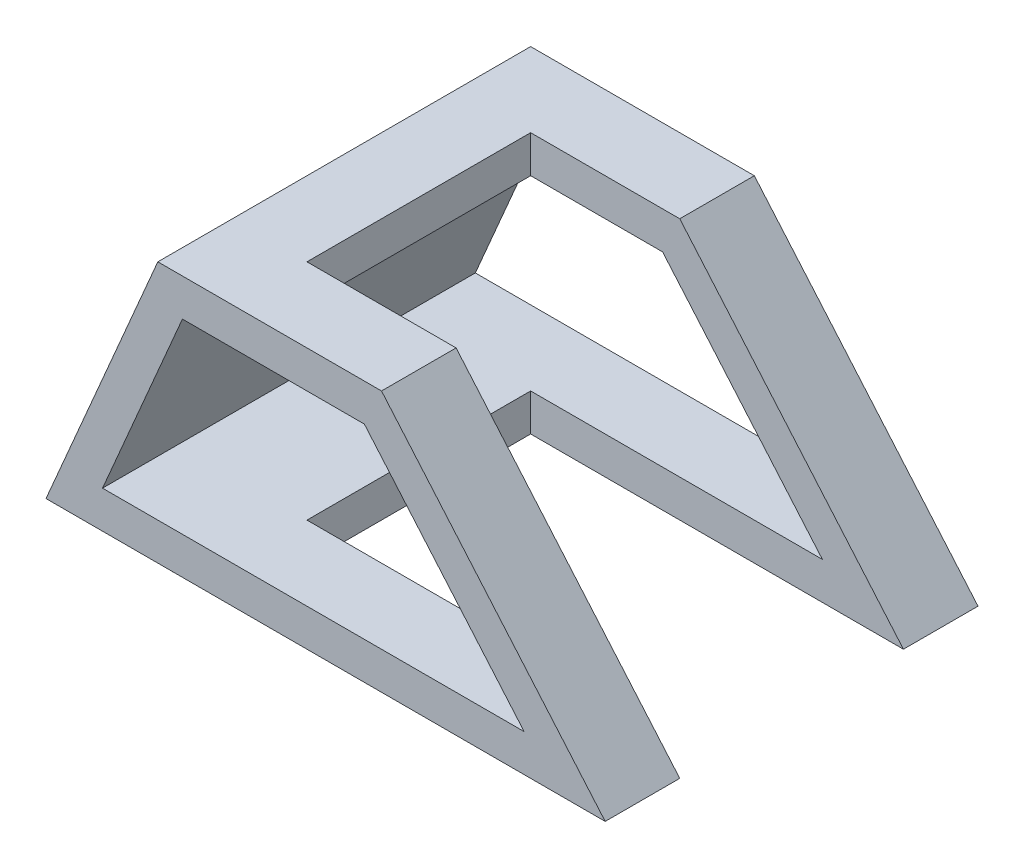
ISO-10303-21;
HEADER;
FILE_DESCRIPTION(('STEP AP214'),'2;1');
FILE_NAME('part.step','',(''),(''),'','','');
FILE_SCHEMA(('AUTOMOTIVE_DESIGN { 1 0 10303 214 1 1 1 1 }'));
ENDSEC;
DATA;
#1=APPLICATION_CONTEXT('core data for automotive mechanical design processes');
#2=APPLICATION_PROTOCOL_DEFINITION('international standard','automotive_design',2000,#1);
#3=PRODUCT_CONTEXT('',#1,'mechanical');
#4=PRODUCT('Part','Part','',(#3));
#5=PRODUCT_RELATED_PRODUCT_CATEGORY('part','',(#4));
#6=PRODUCT_DEFINITION_FORMATION('','',#4);
#7=PRODUCT_DEFINITION_CONTEXT('part definition',#1,'design');
#8=PRODUCT_DEFINITION('design','',#6,#7);
#9=PRODUCT_DEFINITION_SHAPE('','',#8);
#10=(LENGTH_UNIT() NAMED_UNIT(*) SI_UNIT(.MILLI.,.METRE.));
#11=(NAMED_UNIT(*) PLANE_ANGLE_UNIT() SI_UNIT($,.RADIAN.));
#12=(NAMED_UNIT(*) SI_UNIT($,.STERADIAN.) SOLID_ANGLE_UNIT());
#13=UNCERTAINTY_MEASURE_WITH_UNIT(LENGTH_MEASURE(1.E-05),#10,'distance_accuracy_value','');
#14=(GEOMETRIC_REPRESENTATION_CONTEXT(3) GLOBAL_UNCERTAINTY_ASSIGNED_CONTEXT((#13)) GLOBAL_UNIT_ASSIGNED_CONTEXT((#10,
#11,#12)) REPRESENTATION_CONTEXT('',''));
#15=CARTESIAN_POINT('',(0.,0.,0.));
#16=DIRECTION('',(0.,0.,1.));
#17=DIRECTION('',(1.,0.,0.));
#18=AXIS2_PLACEMENT_3D('',#15,#16,#17);
#19=CARTESIAN_POINT('',(0.,0.,50.));
#20=DIRECTION('',(0.,1.,0.));
#21=DIRECTION('',(0.,0.,1.));
#22=AXIS2_PLACEMENT_3D('',#19,#20,#21);
#23=PLANE('',#22);
#24=DIRECTION('',(1.,0.,0.));
#25=VECTOR('',#24,1.);
#26=CARTESIAN_POINT('',(0.,0.,-30.));
#27=LINE('',#26,#25);
#28=CARTESIAN_POINT('',(50.,0.,-30.));
#29=VERTEX_POINT('',#28);
#30=CARTESIAN_POINT('',(150.,0.,-30.));
#31=VERTEX_POINT('',#30);
#32=EDGE_CURVE('E172',#29,#31,#27,.T.);
#33=ORIENTED_EDGE('',*,*,#32,.F.);
#34=DIRECTION('',(0.,0.,1.));
#35=VECTOR('',#34,1.);
#36=CARTESIAN_POINT('',(50.,0.,-30.));
#37=LINE('',#36,#35);
#38=CARTESIAN_POINT('',(50.,0.,30.));
#39=VERTEX_POINT('',#38);
#40=EDGE_CURVE('E156',#29,#39,#37,.T.);
#41=ORIENTED_EDGE('',*,*,#40,.T.);
#42=DIRECTION('',(1.,0.,0.));
#43=VECTOR('',#42,1.);
#44=CARTESIAN_POINT('',(0.,0.,30.));
#45=LINE('',#44,#43);
#46=CARTESIAN_POINT('',(150.,0.,30.));
#47=VERTEX_POINT('',#46);
#48=EDGE_CURVE('E195',#39,#47,#45,.T.);
#49=ORIENTED_EDGE('',*,*,#48,.T.);
#50=DIRECTION('',(0.,0.,-1.));
#51=VECTOR('',#50,1.);
#52=CARTESIAN_POINT('',(150.,0.,50.));
#53=LINE('',#52,#51);
#54=CARTESIAN_POINT('',(150.,0.,50.));
#55=VERTEX_POINT('',#54);
#56=EDGE_CURVE('E11',#55,#47,#53,.T.);
#57=ORIENTED_EDGE('',*,*,#56,.F.);
#58=DIRECTION('',(1.,0.,0.));
#59=VECTOR('',#58,1.);
#60=CARTESIAN_POINT('',(0.,0.,50.));
#61=LINE('',#60,#59);
#62=CARTESIAN_POINT('',(0.,0.,50.));
#63=VERTEX_POINT('',#62);
#64=EDGE_CURVE('E227',#63,#55,#61,.T.);
#65=ORIENTED_EDGE('',*,*,#64,.F.);
#66=DIRECTION('',(0.,0.,-1.));
#67=VECTOR('',#66,1.);
#68=CARTESIAN_POINT('',(0.,0.,50.));
#69=LINE('',#68,#67);
#70=CARTESIAN_POINT('',(0.,0.,-50.));
#71=VERTEX_POINT('',#70);
#72=EDGE_CURVE('E256',#63,#71,#69,.T.);
#73=ORIENTED_EDGE('',*,*,#72,.T.);
#74=DIRECTION('',(1.,0.,0.));
#75=VECTOR('',#74,1.);
#76=CARTESIAN_POINT('',(0.,0.,-50.));
#77=LINE('',#76,#75);
#78=CARTESIAN_POINT('',(150.,0.,-50.));
#79=VERTEX_POINT('',#78);
#80=EDGE_CURVE('E248',#71,#79,#77,.T.);
#81=ORIENTED_EDGE('',*,*,#80,.T.);
#82=EDGE_CURVE('E51',#31,#79,#53,.T.);
#83=ORIENTED_EDGE('',*,*,#82,.F.);
#84=EDGE_LOOP('',(#33,#41,#49,#57,#65,#73,#81,#83));
#85=FACE_BOUND('',#84,.T.);
#86=ADVANCED_FACE('F42',(#85),#23,.F.);
#87=CARTESIAN_POINT('',(86.4705882352941,74.1176470588235,50.));
#88=DIRECTION('',(-0.759256602365297,-0.650791373455968,0.));
#89=DIRECTION('',(0.650791373455968,-0.759256602365297,0.));
#90=AXIS2_PLACEMENT_3D('',#87,#88,#89);
#91=PLANE('',#90);
#92=DIRECTION('',(-0.650791373455968,0.759256602365297,0.));
#93=VECTOR('',#92,1.);
#94=CARTESIAN_POINT('',(86.4705882352941,74.1176470588235,-30.));
#95=LINE('',#94,#93);
#96=CARTESIAN_POINT('',(90.,70.,-30.));
#97=VERTEX_POINT('',#96);
#98=EDGE_CURVE('E180',#31,#97,#95,.T.);
#99=ORIENTED_EDGE('',*,*,#98,.F.);
#100=ORIENTED_EDGE('',*,*,#82,.T.);
#101=DIRECTION('',(-0.650791373455968,0.759256602365297,0.));
#102=VECTOR('',#101,1.);
#103=CARTESIAN_POINT('',(86.4705882352941,74.1176470588235,-50.));
#104=LINE('',#103,#102);
#105=CARTESIAN_POINT('',(90.,70.,-50.));
#106=VERTEX_POINT('',#105);
#107=EDGE_CURVE('E250',#79,#106,#104,.T.);
#108=ORIENTED_EDGE('',*,*,#107,.T.);
#109=DIRECTION('',(0.,0.,-1.));
#110=VECTOR('',#109,1.);
#111=CARTESIAN_POINT('',(90.,70.,50.));
#112=LINE('',#111,#110);
#113=EDGE_CURVE('E262',#97,#106,#112,.T.);
#114=ORIENTED_EDGE('',*,*,#113,.F.);
#115=EDGE_LOOP('',(#99,#100,#108,#114));
#116=FACE_BOUND('',#115,.T.);
#117=ADVANCED_FACE('F320',(#116),#91,.F.);
#118=CARTESIAN_POINT('',(0.,70.,50.));
#119=DIRECTION('',(0.,-1.,0.));
#120=DIRECTION('',(1.,0.,0.));
#121=AXIS2_PLACEMENT_3D('',#118,#119,#120);
#122=PLANE('',#121);
#123=DIRECTION('',(-1.,0.,0.));
#124=VECTOR('',#123,1.);
#125=CARTESIAN_POINT('',(0.,70.,-30.));
#126=LINE('',#125,#124);
#127=CARTESIAN_POINT('',(50.,70.,-30.));
#128=VERTEX_POINT('',#127);
#129=EDGE_CURVE('E182',#97,#128,#126,.T.);
#130=ORIENTED_EDGE('',*,*,#129,.F.);
#131=ORIENTED_EDGE('',*,*,#113,.T.);
#132=DIRECTION('',(-1.,0.,0.));
#133=VECTOR('',#132,1.);
#134=CARTESIAN_POINT('',(0.,70.,-50.));
#135=LINE('',#134,#133);
#136=CARTESIAN_POINT('',(30.,70.,-50.));
#137=VERTEX_POINT('',#136);
#138=EDGE_CURVE('E253',#106,#137,#135,.T.);
#139=ORIENTED_EDGE('',*,*,#138,.T.);
#140=DIRECTION('',(0.,0.,-1.));
#141=VECTOR('',#140,1.);
#142=CARTESIAN_POINT('',(30.,70.,50.));
#143=LINE('',#142,#141);
#144=CARTESIAN_POINT('',(30.,70.,50.));
#145=VERTEX_POINT('',#144);
#146=EDGE_CURVE('E259',#145,#137,#143,.T.);
#147=ORIENTED_EDGE('',*,*,#146,.F.);
#148=DIRECTION('',(-1.,0.,0.));
#149=VECTOR('',#148,1.);
#150=CARTESIAN_POINT('',(0.,70.,50.));
#151=LINE('',#150,#149);
#152=CARTESIAN_POINT('',(90.,70.,50.));
#153=VERTEX_POINT('',#152);
#154=EDGE_CURVE('E232',#153,#145,#151,.T.);
#155=ORIENTED_EDGE('',*,*,#154,.F.);
#156=CARTESIAN_POINT('',(90.,70.,30.));
#157=VERTEX_POINT('',#156);
#158=EDGE_CURVE('E263',#153,#157,#112,.T.);
#159=ORIENTED_EDGE('',*,*,#158,.T.);
#160=DIRECTION('',(-1.,0.,0.));
#161=VECTOR('',#160,1.);
#162=CARTESIAN_POINT('',(0.,70.,30.));
#163=LINE('',#162,#161);
#164=CARTESIAN_POINT('',(50.,70.,30.));
#165=VERTEX_POINT('',#164);
#166=EDGE_CURVE('E200',#157,#165,#163,.T.);
#167=ORIENTED_EDGE('',*,*,#166,.T.);
#168=DIRECTION('',(0.,0.,1.));
#169=VECTOR('',#168,1.);
#170=CARTESIAN_POINT('',(50.,70.,-30.));
#171=LINE('',#170,#169);
#172=EDGE_CURVE('E167',#128,#165,#171,.T.);
#173=ORIENTED_EDGE('',*,*,#172,.F.);
#174=EDGE_LOOP('',(#130,#131,#139,#147,#155,#159,#167,#173));
#175=FACE_BOUND('',#174,.T.);
#176=ADVANCED_FACE('F300',(#175),#122,.F.);
#177=CARTESIAN_POINT('',(78.8780222116411,67.6097333242638,50.));
#178=DIRECTION('',(-0.759256602365297,-0.650791373455968,0.));
#179=DIRECTION('',(0.650791373455968,-0.759256602365297,0.));
#180=AXIS2_PLACEMENT_3D('',#177,#178,#179);
#181=PLANE('',#180);
#182=DIRECTION('',(0.,0.,-1.));
#183=VECTOR('',#182,1.);
#184=CARTESIAN_POINT('',(128.257793632439,10.,50.));
#185=LINE('',#184,#183);
#186=CARTESIAN_POINT('',(128.257793632439,10.,-30.));
#187=VERTEX_POINT('',#186);
#188=CARTESIAN_POINT('',(128.257793632439,10.,-50.));
#189=VERTEX_POINT('',#188);
#190=EDGE_CURVE('E271',#187,#189,#185,.T.);
#191=ORIENTED_EDGE('',*,*,#190,.F.);
#192=DIRECTION('',(-0.650791373455968,0.759256602365297,0.));
#193=VECTOR('',#192,1.);
#194=CARTESIAN_POINT('',(78.8780222116411,67.6097333242638,-30.));
#195=LINE('',#194,#193);
#196=CARTESIAN_POINT('',(85.4006507752958,60.,-30.));
#197=VERTEX_POINT('',#196);
#198=EDGE_CURVE('E190',#187,#197,#195,.T.);
#199=ORIENTED_EDGE('',*,*,#198,.T.);
#200=DIRECTION('',(0.,0.,-1.));
#201=VECTOR('',#200,1.);
#202=CARTESIAN_POINT('',(85.4006507752958,60.,50.));
#203=LINE('',#202,#201);
#204=CARTESIAN_POINT('',(85.4006507752958,60.,-50.));
#205=VERTEX_POINT('',#204);
#206=EDGE_CURVE('E236',#197,#205,#203,.T.);
#207=ORIENTED_EDGE('',*,*,#206,.T.);
#208=DIRECTION('',(-0.650791373455968,0.759256602365297,0.));
#209=VECTOR('',#208,1.);
#210=CARTESIAN_POINT('',(78.8780222116411,67.6097333242638,-50.));
#211=LINE('',#210,#209);
#212=EDGE_CURVE('E209',#189,#205,#211,.T.);
#213=ORIENTED_EDGE('',*,*,#212,.F.);
#214=EDGE_LOOP('',(#191,#199,#207,#213));
#215=FACE_BOUND('',#214,.T.);
#216=ADVANCED_FACE('F322',(#215),#181,.T.);
#217=CARTESIAN_POINT('',(0.,10.,50.));
#218=DIRECTION('',(0.,1.,0.));
#219=DIRECTION('',(0.,0.,1.));
#220=AXIS2_PLACEMENT_3D('',#217,#218,#219);
#221=PLANE('',#220);
#222=DIRECTION('',(0.,0.,1.));
#223=VECTOR('',#222,1.);
#224=CARTESIAN_POINT('',(50.,10.,-30.));
#225=LINE('',#224,#223);
#226=CARTESIAN_POINT('',(50.,10.,-30.));
#227=VERTEX_POINT('',#226);
#228=CARTESIAN_POINT('',(50.,10.,30.));
#229=VERTEX_POINT('',#228);
#230=EDGE_CURVE('E207',#227,#229,#225,.T.);
#231=ORIENTED_EDGE('',*,*,#230,.F.);
#232=DIRECTION('',(1.,0.,0.));
#233=VECTOR('',#232,1.);
#234=CARTESIAN_POINT('',(0.,10.,-30.));
#235=LINE('',#234,#233);
#236=EDGE_CURVE('E168',#227,#187,#235,.T.);
#237=ORIENTED_EDGE('',*,*,#236,.T.);
#238=ORIENTED_EDGE('',*,*,#190,.T.);
#239=DIRECTION('',(1.,0.,0.));
#240=VECTOR('',#239,1.);
#241=CARTESIAN_POINT('',(0.,10.,-50.));
#242=LINE('',#241,#240);
#243=CARTESIAN_POINT('',(15.1653901512342,10.,-50.));
#244=VERTEX_POINT('',#243);
#245=EDGE_CURVE('E239',#244,#189,#242,.T.);
#246=ORIENTED_EDGE('',*,*,#245,.F.);
#247=DIRECTION('',(0.,0.,-1.));
#248=VECTOR('',#247,1.);
#249=CARTESIAN_POINT('',(15.1653901512342,10.,50.));
#250=LINE('',#249,#248);
#251=CARTESIAN_POINT('',(15.1653901512342,10.,50.));
#252=VERTEX_POINT('',#251);
#253=EDGE_CURVE('E270',#252,#244,#250,.T.);
#254=ORIENTED_EDGE('',*,*,#253,.F.);
#255=DIRECTION('',(1.,0.,0.));
#256=VECTOR('',#255,1.);
#257=CARTESIAN_POINT('',(0.,10.,50.));
#258=LINE('',#257,#256);
#259=CARTESIAN_POINT('',(128.257793632439,10.,50.));
#260=VERTEX_POINT('',#259);
#261=EDGE_CURVE('E217',#252,#260,#258,.T.);
#262=ORIENTED_EDGE('',*,*,#261,.T.);
#263=CARTESIAN_POINT('',(128.257793632439,10.,30.));
#264=VERTEX_POINT('',#263);
#265=EDGE_CURVE('E46',#260,#264,#185,.T.);
#266=ORIENTED_EDGE('',*,*,#265,.T.);
#267=DIRECTION('',(1.,0.,0.));
#268=VECTOR('',#267,1.);
#269=CARTESIAN_POINT('',(0.,10.,30.));
#270=LINE('',#269,#268);
#271=EDGE_CURVE('E175',#229,#264,#270,.T.);
#272=ORIENTED_EDGE('',*,*,#271,.F.);
#273=EDGE_LOOP('',(#231,#237,#238,#246,#254,#262,#266,#272));
#274=FACE_BOUND('',#273,.T.);
#275=ADVANCED_FACE('F280',(#274),#221,.T.);
#276=CARTESIAN_POINT('',(0.,60.,50.));
#277=DIRECTION('',(0.,-1.,0.));
#278=DIRECTION('',(0.,0.,-1.));
#279=AXIS2_PLACEMENT_3D('',#276,#277,#278);
#280=PLANE('',#279);
#281=ORIENTED_EDGE('',*,*,#206,.F.);
#282=DIRECTION('',(-1.,0.,0.));
#283=VECTOR('',#282,1.);
#284=CARTESIAN_POINT('',(0.,60.,-30.));
#285=LINE('',#284,#283);
#286=CARTESIAN_POINT('',(50.,60.,-30.));
#287=VERTEX_POINT('',#286);
#288=EDGE_CURVE('E187',#197,#287,#285,.T.);
#289=ORIENTED_EDGE('',*,*,#288,.T.);
#290=DIRECTION('',(0.,0.,1.));
#291=VECTOR('',#290,1.);
#292=CARTESIAN_POINT('',(50.,60.,-30.));
#293=LINE('',#292,#291);
#294=CARTESIAN_POINT('',(50.,60.,30.));
#295=VERTEX_POINT('',#294);
#296=EDGE_CURVE('E210',#287,#295,#293,.T.);
#297=ORIENTED_EDGE('',*,*,#296,.T.);
#298=DIRECTION('',(-1.,0.,0.));
#299=VECTOR('',#298,1.);
#300=CARTESIAN_POINT('',(0.,60.,30.));
#301=LINE('',#300,#299);
#302=CARTESIAN_POINT('',(85.4006507752958,60.,30.));
#303=VERTEX_POINT('',#302);
#304=EDGE_CURVE('E203',#303,#295,#301,.T.);
#305=ORIENTED_EDGE('',*,*,#304,.F.);
#306=CARTESIAN_POINT('',(85.4006507752958,60.,50.));
#307=VERTEX_POINT('',#306);
#308=EDGE_CURVE('E266',#307,#303,#203,.T.);
#309=ORIENTED_EDGE('',*,*,#308,.F.);
#310=DIRECTION('',(-1.,0.,0.));
#311=VECTOR('',#310,1.);
#312=CARTESIAN_POINT('',(0.,60.,50.));
#313=LINE('',#312,#311);
#314=CARTESIAN_POINT('',(36.5939615798056,60.,50.));
#315=VERTEX_POINT('',#314);
#316=EDGE_CURVE('E224',#307,#315,#313,.T.);
#317=ORIENTED_EDGE('',*,*,#316,.T.);
#318=DIRECTION('',(0.,0.,-1.));
#319=VECTOR('',#318,1.);
#320=CARTESIAN_POINT('',(36.5939615798056,60.,50.));
#321=LINE('',#320,#319);
#322=CARTESIAN_POINT('',(36.5939615798056,60.,-50.));
#323=VERTEX_POINT('',#322);
#324=EDGE_CURVE('E269',#315,#323,#321,.T.);
#325=ORIENTED_EDGE('',*,*,#324,.T.);
#326=DIRECTION('',(-1.,0.,0.));
#327=VECTOR('',#326,1.);
#328=CARTESIAN_POINT('',(0.,60.,-50.));
#329=LINE('',#328,#327);
#330=EDGE_CURVE('E245',#205,#323,#329,.T.);
#331=ORIENTED_EDGE('',*,*,#330,.F.);
#332=EDGE_LOOP('',(#281,#289,#297,#305,#309,#317,#325,#331));
#333=FACE_BOUND('',#332,.T.);
#334=ADVANCED_FACE('F291',(#333),#280,.T.);
#335=ORIENTED_EDGE('',*,*,#56,.T.);
#336=DIRECTION('',(-0.650791373455968,0.759256602365297,0.));
#337=VECTOR('',#336,1.);
#338=CARTESIAN_POINT('',(86.4705882352941,74.1176470588235,30.));
#339=LINE('',#338,#337);
#340=EDGE_CURVE('E197',#47,#157,#339,.T.);
#341=ORIENTED_EDGE('',*,*,#340,.T.);
#342=ORIENTED_EDGE('',*,*,#158,.F.);
#343=DIRECTION('',(-0.650791373455968,0.759256602365297,0.));
#344=VECTOR('',#343,1.);
#345=CARTESIAN_POINT('',(86.4705882352941,74.1176470588235,50.));
#346=LINE('',#345,#344);
#347=EDGE_CURVE('E230',#55,#153,#346,.T.);
#348=ORIENTED_EDGE('',*,*,#347,.F.);
#349=EDGE_LOOP('',(#335,#341,#342,#348));
#350=FACE_BOUND('',#349,.T.);
#351=ADVANCED_FACE('F304',(#350),#91,.F.);
#352=DIRECTION('',(-0.650791373455968,0.759256602365297,0.));
#353=VECTOR('',#352,1.);
#354=CARTESIAN_POINT('',(78.8780222116411,67.6097333242638,30.));
#355=LINE('',#354,#353);
#356=EDGE_CURVE('E65',#264,#303,#355,.T.);
#357=ORIENTED_EDGE('',*,*,#356,.F.);
#358=ORIENTED_EDGE('',*,*,#265,.F.);
#359=DIRECTION('',(-0.650791373455968,0.759256602365297,0.));
#360=VECTOR('',#359,1.);
#361=CARTESIAN_POINT('',(78.8780222116411,67.6097333242638,50.));
#362=LINE('',#361,#360);
#363=EDGE_CURVE('E214',#260,#307,#362,.T.);
#364=ORIENTED_EDGE('',*,*,#363,.T.);
#365=ORIENTED_EDGE('',*,*,#308,.T.);
#366=EDGE_LOOP('',(#357,#358,#364,#365));
#367=FACE_BOUND('',#366,.T.);
#368=ADVANCED_FACE('F44',(#367),#181,.T.);
#369=CARTESIAN_POINT('',(9.19145030018058,-3.93919298579168,50.));
#370=DIRECTION('',(0.919145030018058,-0.393919298579168,0.));
#371=DIRECTION('',(0.393919298579168,0.919145030018058,0.));
#372=AXIS2_PLACEMENT_3D('',#369,#370,#371);
#373=PLANE('',#372);
#374=DIRECTION('',(-0.393919298579168,-0.919145030018058,0.));
#375=VECTOR('',#374,1.);
#376=CARTESIAN_POINT('',(9.19145030018058,-3.93919298579168,-50.));
#377=LINE('',#376,#375);
#378=EDGE_CURVE('E242',#323,#244,#377,.T.);
#379=ORIENTED_EDGE('',*,*,#378,.F.);
#380=ORIENTED_EDGE('',*,*,#324,.F.);
#381=DIRECTION('',(-0.393919298579168,-0.919145030018058,0.));
#382=VECTOR('',#381,1.);
#383=CARTESIAN_POINT('',(9.19145030018058,-3.93919298579168,50.));
#384=LINE('',#383,#382);
#385=EDGE_CURVE('E221',#315,#252,#384,.T.);
#386=ORIENTED_EDGE('',*,*,#385,.T.);
#387=ORIENTED_EDGE('',*,*,#253,.T.);
#388=EDGE_LOOP('',(#379,#380,#386,#387));
#389=FACE_BOUND('',#388,.T.);
#390=ADVANCED_FACE('F324',(#389),#373,.T.);
#391=CARTESIAN_POINT('',(0.,0.,50.));
#392=DIRECTION('',(0.919145030018058,-0.393919298579168,0.));
#393=DIRECTION('',(0.393919298579168,0.919145030018058,0.));
#394=AXIS2_PLACEMENT_3D('',#391,#392,#393);
#395=PLANE('',#394);
#396=DIRECTION('',(-0.393919298579168,-0.919145030018058,0.));
#397=VECTOR('',#396,1.);
#398=CARTESIAN_POINT('',(0.,0.,-50.));
#399=LINE('',#398,#397);
#400=EDGE_CURVE('E218',#137,#71,#399,.T.);
#401=ORIENTED_EDGE('',*,*,#400,.T.);
#402=ORIENTED_EDGE('',*,*,#72,.F.);
#403=DIRECTION('',(-0.393919298579168,-0.919145030018058,0.));
#404=VECTOR('',#403,1.);
#405=CARTESIAN_POINT('',(0.,0.,50.));
#406=LINE('',#405,#404);
#407=EDGE_CURVE('E234',#145,#63,#406,.T.);
#408=ORIENTED_EDGE('',*,*,#407,.F.);
#409=ORIENTED_EDGE('',*,*,#146,.T.);
#410=EDGE_LOOP('',(#401,#402,#408,#409));
#411=FACE_BOUND('',#410,.T.);
#412=ADVANCED_FACE('F312',(#411),#395,.F.);
#413=CARTESIAN_POINT('',(0.,0.,50.));
#414=DIRECTION('',(0.,0.,1.));
#415=DIRECTION('',(1.,0.,0.));
#416=AXIS2_PLACEMENT_3D('',#413,#414,#415);
#417=PLANE('',#416);
#418=ORIENTED_EDGE('',*,*,#363,.F.);
#419=ORIENTED_EDGE('',*,*,#261,.F.);
#420=ORIENTED_EDGE('',*,*,#385,.F.);
#421=ORIENTED_EDGE('',*,*,#316,.F.);
#422=EDGE_LOOP('',(#418,#419,#420,#421));
#423=FACE_BOUND('',#422,.T.);
#424=ORIENTED_EDGE('',*,*,#64,.T.);
#425=ORIENTED_EDGE('',*,*,#347,.T.);
#426=ORIENTED_EDGE('',*,*,#154,.T.);
#427=ORIENTED_EDGE('',*,*,#407,.T.);
#428=EDGE_LOOP('',(#424,#425,#426,#427));
#429=FACE_BOUND('',#428,.T.);
#430=ADVANCED_FACE('F286',(#423,#429),#417,.T.);
#431=CARTESIAN_POINT('',(0.,0.,-50.));
#432=DIRECTION('',(0.,0.,1.));
#433=DIRECTION('',(1.,0.,0.));
#434=AXIS2_PLACEMENT_3D('',#431,#432,#433);
#435=PLANE('',#434);
#436=ORIENTED_EDGE('',*,*,#212,.T.);
#437=ORIENTED_EDGE('',*,*,#330,.T.);
#438=ORIENTED_EDGE('',*,*,#378,.T.);
#439=ORIENTED_EDGE('',*,*,#245,.T.);
#440=EDGE_LOOP('',(#436,#437,#438,#439));
#441=FACE_BOUND('',#440,.T.);
#442=ORIENTED_EDGE('',*,*,#80,.F.);
#443=ORIENTED_EDGE('',*,*,#400,.F.);
#444=ORIENTED_EDGE('',*,*,#138,.F.);
#445=ORIENTED_EDGE('',*,*,#107,.F.);
#446=EDGE_LOOP('',(#442,#443,#444,#445));
#447=FACE_BOUND('',#446,.T.);
#448=ADVANCED_FACE('F316',(#441,#447),#435,.F.);
#449=CARTESIAN_POINT('',(50.,0.,-30.));
#450=DIRECTION('',(1.,0.,0.));
#451=DIRECTION('',(0.,0.,-1.));
#452=AXIS2_PLACEMENT_3D('',#449,#450,#451);
#453=PLANE('',#452);
#454=DIRECTION('',(0.,1.,0.));
#455=VECTOR('',#454,1.);
#456=CARTESIAN_POINT('',(50.,0.,30.));
#457=LINE('',#456,#455);
#458=EDGE_CURVE('E162',#39,#229,#457,.T.);
#459=ORIENTED_EDGE('',*,*,#458,.F.);
#460=ORIENTED_EDGE('',*,*,#40,.F.);
#461=DIRECTION('',(0.,1.,0.));
#462=VECTOR('',#461,1.);
#463=CARTESIAN_POINT('',(50.,0.,-30.));
#464=LINE('',#463,#462);
#465=EDGE_CURVE('E159',#29,#227,#464,.T.);
#466=ORIENTED_EDGE('',*,*,#465,.T.);
#467=ORIENTED_EDGE('',*,*,#230,.T.);
#468=EDGE_LOOP('',(#459,#460,#466,#467));
#469=FACE_BOUND('',#468,.T.);
#470=ADVANCED_FACE('F158',(#469),#453,.T.);
#471=EDGE_CURVE('E59',#295,#165,#457,.T.);
#472=ORIENTED_EDGE('',*,*,#471,.F.);
#473=ORIENTED_EDGE('',*,*,#296,.F.);
#474=EDGE_CURVE('E177',#287,#128,#464,.T.);
#475=ORIENTED_EDGE('',*,*,#474,.T.);
#476=ORIENTED_EDGE('',*,*,#172,.T.);
#477=EDGE_LOOP('',(#472,#473,#475,#476));
#478=FACE_BOUND('',#477,.T.);
#479=ADVANCED_FACE('F295',(#478),#453,.T.);
#480=CARTESIAN_POINT('',(0.,0.,-30.));
#481=DIRECTION('',(0.,0.,1.));
#482=DIRECTION('',(1.,0.,0.));
#483=AXIS2_PLACEMENT_3D('',#480,#481,#482);
#484=PLANE('',#483);
#485=ORIENTED_EDGE('',*,*,#465,.F.);
#486=ORIENTED_EDGE('',*,*,#32,.T.);
#487=ORIENTED_EDGE('',*,*,#98,.T.);
#488=ORIENTED_EDGE('',*,*,#129,.T.);
#489=ORIENTED_EDGE('',*,*,#474,.F.);
#490=ORIENTED_EDGE('',*,*,#288,.F.);
#491=ORIENTED_EDGE('',*,*,#198,.F.);
#492=ORIENTED_EDGE('',*,*,#236,.F.);
#493=EDGE_LOOP('',(#485,#486,#487,#488,#489,#490,#491,#492));
#494=FACE_BOUND('',#493,.T.);
#495=ADVANCED_FACE('F171',(#494),#484,.T.);
#496=CARTESIAN_POINT('',(0.,0.,30.));
#497=DIRECTION('',(0.,0.,1.));
#498=DIRECTION('',(1.,0.,0.));
#499=AXIS2_PLACEMENT_3D('',#496,#497,#498);
#500=PLANE('',#499);
#501=ORIENTED_EDGE('',*,*,#458,.T.);
#502=ORIENTED_EDGE('',*,*,#271,.T.);
#503=ORIENTED_EDGE('',*,*,#356,.T.);
#504=ORIENTED_EDGE('',*,*,#304,.T.);
#505=ORIENTED_EDGE('',*,*,#471,.T.);
#506=ORIENTED_EDGE('',*,*,#166,.F.);
#507=ORIENTED_EDGE('',*,*,#340,.F.);
#508=ORIENTED_EDGE('',*,*,#48,.F.);
#509=EDGE_LOOP('',(#501,#502,#503,#504,#505,#506,#507,#508));
#510=FACE_BOUND('',#509,.T.);
#511=ADVANCED_FACE('F293',(#510),#500,.F.);
#512=CLOSED_SHELL('',(#86,#117,#176,#216,#275,#334,#351,#368,#390,#412,#430,#448,#470,#479,#495,#511));
#513=MANIFOLD_SOLID_BREP('B2',#512);
#514=ADVANCED_BREP_SHAPE_REPRESENTATION('',(#18,#513),#14);
#515=SHAPE_DEFINITION_REPRESENTATION(#9,#514);
ENDSEC;
END-ISO-10303-21;
